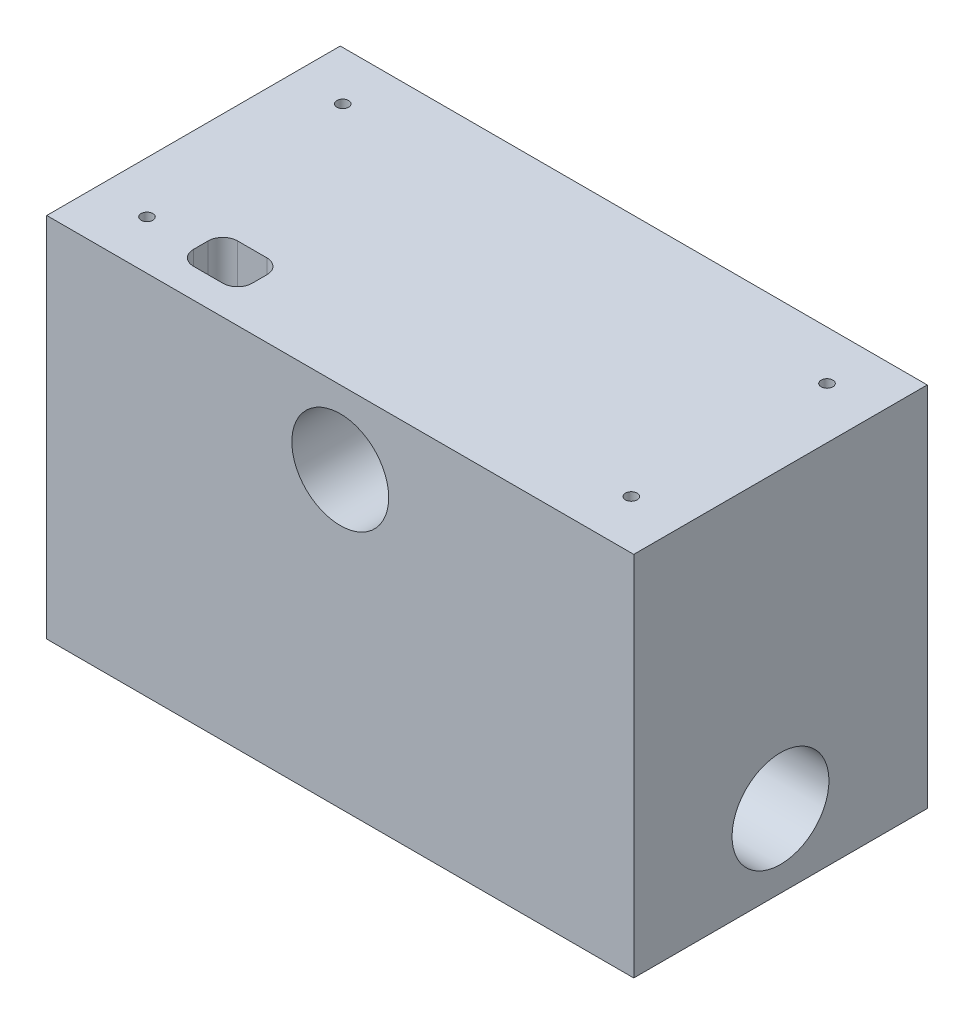
ISO-10303-21;
HEADER;
FILE_DESCRIPTION(('STEP AP214'),'2;1');
FILE_NAME('part.step','',(''),(''),'','','');
FILE_SCHEMA(('AUTOMOTIVE_DESIGN { 1 0 10303 214 1 1 1 1 }'));
ENDSEC;
DATA;
#1=APPLICATION_CONTEXT('core data for automotive mechanical design processes');
#2=APPLICATION_PROTOCOL_DEFINITION('international standard','automotive_design',2000,#1);
#3=PRODUCT_CONTEXT('',#1,'mechanical');
#4=PRODUCT('Part','Part','',(#3));
#5=PRODUCT_RELATED_PRODUCT_CATEGORY('part','',(#4));
#6=PRODUCT_DEFINITION_FORMATION('','',#4);
#7=PRODUCT_DEFINITION_CONTEXT('part definition',#1,'design');
#8=PRODUCT_DEFINITION('design','',#6,#7);
#9=PRODUCT_DEFINITION_SHAPE('','',#8);
#10=(LENGTH_UNIT() NAMED_UNIT(*) SI_UNIT(.MILLI.,.METRE.));
#11=(NAMED_UNIT(*) PLANE_ANGLE_UNIT() SI_UNIT($,.RADIAN.));
#12=(NAMED_UNIT(*) SI_UNIT($,.STERADIAN.) SOLID_ANGLE_UNIT());
#13=UNCERTAINTY_MEASURE_WITH_UNIT(LENGTH_MEASURE(1.E-05),#10,'distance_accuracy_value','');
#14=(GEOMETRIC_REPRESENTATION_CONTEXT(3) GLOBAL_UNCERTAINTY_ASSIGNED_CONTEXT((#13)) GLOBAL_UNIT_ASSIGNED_CONTEXT((#10,
#11,#12)) REPRESENTATION_CONTEXT('',''));
#15=CARTESIAN_POINT('',(0.,0.,0.));
#16=DIRECTION('',(0.,0.,1.));
#17=DIRECTION('',(1.,0.,0.));
#18=AXIS2_PLACEMENT_3D('',#15,#16,#17);
#19=CARTESIAN_POINT('',(25.4,15.875,25.4));
#20=DIRECTION('',(-1.,0.,0.));
#21=DIRECTION('',(0.,-1.,0.));
#22=AXIS2_PLACEMENT_3D('',#19,#20,#21);
#23=PLANE('',#22);
#24=CARTESIAN_POINT('',(25.4,-9.52500000000001,12.7));
#25=DIRECTION('',(-1.,0.,0.));
#26=DIRECTION('',(0.,-1.,0.));
#27=AXIS2_PLACEMENT_3D('',#24,#25,#26);
#28=CIRCLE('',#27,4.191);
#29=CARTESIAN_POINT('',(25.4,-13.716,12.7));
#30=VERTEX_POINT('',#29);
#31=EDGE_CURVE('E273',#30,#30,#28,.T.);
#32=ORIENTED_EDGE('',*,*,#31,.T.);
#33=EDGE_LOOP('',(#32));
#34=FACE_BOUND('',#33,.T.);
#35=DIRECTION('',(0.,1.,0.));
#36=VECTOR('',#35,1.);
#37=CARTESIAN_POINT('',(25.4,15.875,0.));
#38=LINE('',#37,#36);
#39=CARTESIAN_POINT('',(25.4,-15.875,0.));
#40=VERTEX_POINT('',#39);
#41=CARTESIAN_POINT('',(25.4,15.875,0.));
#42=VERTEX_POINT('',#41);
#43=EDGE_CURVE('E148',#40,#42,#38,.T.);
#44=ORIENTED_EDGE('',*,*,#43,.T.);
#45=DIRECTION('',(0.,0.,-1.));
#46=VECTOR('',#45,1.);
#47=CARTESIAN_POINT('',(25.4,15.875,25.4));
#48=LINE('',#47,#46);
#49=CARTESIAN_POINT('',(25.4,15.875,25.4));
#50=VERTEX_POINT('',#49);
#51=EDGE_CURVE('E129',#50,#42,#48,.T.);
#52=ORIENTED_EDGE('',*,*,#51,.F.);
#53=DIRECTION('',(0.,1.,0.));
#54=VECTOR('',#53,1.);
#55=CARTESIAN_POINT('',(25.4,15.875,25.4));
#56=LINE('',#55,#54);
#57=CARTESIAN_POINT('',(25.4,-15.875,25.4));
#58=VERTEX_POINT('',#57);
#59=EDGE_CURVE('E136',#58,#50,#56,.T.);
#60=ORIENTED_EDGE('',*,*,#59,.F.);
#61=DIRECTION('',(0.,0.,-1.));
#62=VECTOR('',#61,1.);
#63=CARTESIAN_POINT('',(25.4,-15.875,25.4));
#64=LINE('',#63,#62);
#65=EDGE_CURVE('E278',#58,#40,#64,.T.);
#66=ORIENTED_EDGE('',*,*,#65,.T.);
#67=EDGE_LOOP('',(#44,#52,#60,#66));
#68=FACE_BOUND('',#67,.T.);
#69=ADVANCED_FACE('F35',(#34,#68),#23,.F.);
#70=CARTESIAN_POINT('',(-25.4,15.875,25.4));
#71=DIRECTION('',(0.,-1.,0.));
#72=DIRECTION('',(0.,0.,-1.));
#73=AXIS2_PLACEMENT_3D('',#70,#71,#72);
#74=PLANE('',#73);
#75=DIRECTION('',(1.,0.,0.));
#76=VECTOR('',#75,1.);
#77=CARTESIAN_POINT('',(-16.51,15.875,22.86));
#78=LINE('',#77,#76);
#79=CARTESIAN_POINT('',(-15.24,15.875,22.86));
#80=VERTEX_POINT('',#79);
#81=CARTESIAN_POINT('',(-12.7,15.875,22.86));
#82=VERTEX_POINT('',#81);
#83=EDGE_CURVE('E197',#80,#82,#78,.T.);
#84=ORIENTED_EDGE('',*,*,#83,.F.);
#85=CARTESIAN_POINT('',(-15.24,15.875,21.59));
#86=DIRECTION('',(0.,-1.,0.));
#87=DIRECTION('',(0.,0.,-1.));
#88=AXIS2_PLACEMENT_3D('',#85,#86,#87);
#89=CIRCLE('',#88,1.27);
#90=CARTESIAN_POINT('',(-16.51,15.875,21.59));
#91=VERTEX_POINT('',#90);
#92=EDGE_CURVE('E191',#80,#91,#89,.T.);
#93=ORIENTED_EDGE('',*,*,#92,.T.);
#94=DIRECTION('',(0.,0.,1.));
#95=VECTOR('',#94,1.);
#96=CARTESIAN_POINT('',(-16.51,15.875,19.05));
#97=LINE('',#96,#95);
#98=CARTESIAN_POINT('',(-16.51,15.875,20.32));
#99=VERTEX_POINT('',#98);
#100=EDGE_CURVE('E204',#99,#91,#97,.T.);
#101=ORIENTED_EDGE('',*,*,#100,.F.);
#102=CARTESIAN_POINT('',(-15.24,15.875,20.32));
#103=DIRECTION('',(0.,-1.,0.));
#104=DIRECTION('',(0.,0.,-1.));
#105=AXIS2_PLACEMENT_3D('',#102,#103,#104);
#106=CIRCLE('',#105,1.27);
#107=CARTESIAN_POINT('',(-15.24,15.875,19.05));
#108=VERTEX_POINT('',#107);
#109=EDGE_CURVE('E187',#99,#108,#106,.T.);
#110=ORIENTED_EDGE('',*,*,#109,.T.);
#111=DIRECTION('',(-1.,0.,0.));
#112=VECTOR('',#111,1.);
#113=CARTESIAN_POINT('',(-16.51,15.875,19.05));
#114=LINE('',#113,#112);
#115=CARTESIAN_POINT('',(-12.7,15.875,19.05));
#116=VERTEX_POINT('',#115);
#117=EDGE_CURVE('E224',#116,#108,#114,.T.);
#118=ORIENTED_EDGE('',*,*,#117,.F.);
#119=CARTESIAN_POINT('',(-12.7,15.875,20.32));
#120=DIRECTION('',(0.,-1.,0.));
#121=DIRECTION('',(0.,0.,-1.));
#122=AXIS2_PLACEMENT_3D('',#119,#120,#121);
#123=CIRCLE('',#122,1.27);
#124=CARTESIAN_POINT('',(-11.43,15.875,20.32));
#125=VERTEX_POINT('',#124);
#126=EDGE_CURVE('E183',#116,#125,#123,.T.);
#127=ORIENTED_EDGE('',*,*,#126,.T.);
#128=DIRECTION('',(0.,0.,-1.));
#129=VECTOR('',#128,1.);
#130=CARTESIAN_POINT('',(-11.43,15.875,19.05));
#131=LINE('',#130,#129);
#132=CARTESIAN_POINT('',(-11.43,15.875,21.59));
#133=VERTEX_POINT('',#132);
#134=EDGE_CURVE('E199',#133,#125,#131,.T.);
#135=ORIENTED_EDGE('',*,*,#134,.F.);
#136=CARTESIAN_POINT('',(-12.7,15.875,21.59));
#137=DIRECTION('',(0.,-1.,0.));
#138=DIRECTION('',(0.,0.,-1.));
#139=AXIS2_PLACEMENT_3D('',#136,#137,#138);
#140=CIRCLE('',#139,1.27);
#141=EDGE_CURVE('E43',#133,#82,#140,.T.);
#142=ORIENTED_EDGE('',*,*,#141,.T.);
#143=EDGE_LOOP('',(#84,#93,#101,#110,#118,#127,#135,#142));
#144=FACE_BOUND('',#143,.T.);
#145=CARTESIAN_POINT('',(20.955,15.875,21.1709));
#146=DIRECTION('',(0.,1.,0.));
#147=DIRECTION('',(0.,0.,1.));
#148=AXIS2_PLACEMENT_3D('',#145,#146,#147);
#149=CIRCLE('',#148,0.508000000000002);
#150=CARTESIAN_POINT('',(20.955,15.875,21.6789));
#151=VERTEX_POINT('',#150);
#152=EDGE_CURVE('E240',#151,#151,#149,.T.);
#153=ORIENTED_EDGE('',*,*,#152,.F.);
#154=EDGE_LOOP('',(#153));
#155=FACE_BOUND('',#154,.T.);
#156=CARTESIAN_POINT('',(20.955,15.875,4.2291));
#157=DIRECTION('',(0.,1.,0.));
#158=DIRECTION('',(0.,0.,1.));
#159=AXIS2_PLACEMENT_3D('',#156,#157,#158);
#160=CIRCLE('',#159,0.508000000000002);
#161=CARTESIAN_POINT('',(20.955,15.875,4.7371));
#162=VERTEX_POINT('',#161);
#163=EDGE_CURVE('E244',#162,#162,#160,.T.);
#164=ORIENTED_EDGE('',*,*,#163,.F.);
#165=EDGE_LOOP('',(#164));
#166=FACE_BOUND('',#165,.T.);
#167=CARTESIAN_POINT('',(-20.955,15.875,21.1709));
#168=DIRECTION('',(0.,1.,0.));
#169=DIRECTION('',(0.,0.,1.));
#170=AXIS2_PLACEMENT_3D('',#167,#168,#169);
#171=CIRCLE('',#170,0.508000000000002);
#172=CARTESIAN_POINT('',(-20.955,15.875,21.6789));
#173=VERTEX_POINT('',#172);
#174=EDGE_CURVE('E250',#173,#173,#171,.T.);
#175=ORIENTED_EDGE('',*,*,#174,.F.);
#176=EDGE_LOOP('',(#175));
#177=FACE_BOUND('',#176,.T.);
#178=CARTESIAN_POINT('',(-20.955,15.875,4.2291));
#179=DIRECTION('',(0.,1.,0.));
#180=DIRECTION('',(0.,0.,1.));
#181=AXIS2_PLACEMENT_3D('',#178,#179,#180);
#182=CIRCLE('',#181,0.508000000000002);
#183=CARTESIAN_POINT('',(-20.955,15.875,4.7371));
#184=VERTEX_POINT('',#183);
#185=EDGE_CURVE('E256',#184,#184,#182,.T.);
#186=ORIENTED_EDGE('',*,*,#185,.F.);
#187=EDGE_LOOP('',(#186));
#188=FACE_BOUND('',#187,.T.);
#189=DIRECTION('',(-1.,0.,0.));
#190=VECTOR('',#189,1.);
#191=CARTESIAN_POINT('',(-25.4,15.875,0.));
#192=LINE('',#191,#190);
#193=CARTESIAN_POINT('',(-25.4,15.875,0.));
#194=VERTEX_POINT('',#193);
#195=EDGE_CURVE('E280',#42,#194,#192,.T.);
#196=ORIENTED_EDGE('',*,*,#195,.T.);
#197=DIRECTION('',(0.,0.,-1.));
#198=VECTOR('',#197,1.);
#199=CARTESIAN_POINT('',(-25.4,15.875,25.4));
#200=LINE('',#199,#198);
#201=CARTESIAN_POINT('',(-25.4,15.875,25.4));
#202=VERTEX_POINT('',#201);
#203=EDGE_CURVE('E132',#202,#194,#200,.T.);
#204=ORIENTED_EDGE('',*,*,#203,.F.);
#205=DIRECTION('',(-1.,0.,0.));
#206=VECTOR('',#205,1.);
#207=CARTESIAN_POINT('',(-25.4,15.875,25.4));
#208=LINE('',#207,#206);
#209=EDGE_CURVE('E125',#50,#202,#208,.T.);
#210=ORIENTED_EDGE('',*,*,#209,.F.);
#211=ORIENTED_EDGE('',*,*,#51,.T.);
#212=EDGE_LOOP('',(#196,#204,#210,#211));
#213=FACE_BOUND('',#212,.T.);
#214=ADVANCED_FACE('F127',(#144,#155,#166,#177,#188,#213),#74,.F.);
#215=CARTESIAN_POINT('',(-25.4,15.875,25.4));
#216=DIRECTION('',(1.,0.,0.));
#217=DIRECTION('',(0.,1.,0.));
#218=AXIS2_PLACEMENT_3D('',#215,#216,#217);
#219=PLANE('',#218);
#220=CARTESIAN_POINT('',(-25.4,-9.525,12.7));
#221=DIRECTION('',(-1.,0.,0.));
#222=DIRECTION('',(0.,-1.,0.));
#223=AXIS2_PLACEMENT_3D('',#220,#221,#222);
#224=CIRCLE('',#223,4.191);
#225=CARTESIAN_POINT('',(-25.4,-13.716,12.7));
#226=VERTEX_POINT('',#225);
#227=EDGE_CURVE('E268',#226,#226,#224,.T.);
#228=ORIENTED_EDGE('',*,*,#227,.F.);
#229=EDGE_LOOP('',(#228));
#230=FACE_BOUND('',#229,.T.);
#231=DIRECTION('',(0.,-1.,0.));
#232=VECTOR('',#231,1.);
#233=CARTESIAN_POINT('',(-25.4,15.875,0.));
#234=LINE('',#233,#232);
#235=CARTESIAN_POINT('',(-25.4,-15.875,0.));
#236=VERTEX_POINT('',#235);
#237=EDGE_CURVE('E282',#194,#236,#234,.T.);
#238=ORIENTED_EDGE('',*,*,#237,.T.);
#239=DIRECTION('',(0.,0.,-1.));
#240=VECTOR('',#239,1.);
#241=CARTESIAN_POINT('',(-25.4,-15.875,25.4));
#242=LINE('',#241,#240);
#243=CARTESIAN_POINT('',(-25.4,-15.875,25.4));
#244=VERTEX_POINT('',#243);
#245=EDGE_CURVE('E153',#244,#236,#242,.T.);
#246=ORIENTED_EDGE('',*,*,#245,.F.);
#247=DIRECTION('',(0.,-1.,0.));
#248=VECTOR('',#247,1.);
#249=CARTESIAN_POINT('',(-25.4,15.875,25.4));
#250=LINE('',#249,#248);
#251=EDGE_CURVE('E135',#202,#244,#250,.T.);
#252=ORIENTED_EDGE('',*,*,#251,.F.);
#253=ORIENTED_EDGE('',*,*,#203,.T.);
#254=EDGE_LOOP('',(#238,#246,#252,#253));
#255=FACE_BOUND('',#254,.T.);
#256=ADVANCED_FACE('F292',(#230,#255),#219,.F.);
#257=CARTESIAN_POINT('',(-25.4,-15.875,25.4));
#258=DIRECTION('',(0.,1.,0.));
#259=DIRECTION('',(0.,0.,1.));
#260=AXIS2_PLACEMENT_3D('',#257,#258,#259);
#261=PLANE('',#260);
#262=DIRECTION('',(0.,0.,-1.));
#263=VECTOR('',#262,1.);
#264=CARTESIAN_POINT('',(-11.43,-15.875,25.4));
#265=LINE('',#264,#263);
#266=CARTESIAN_POINT('',(-11.43,-15.875,21.59));
#267=VERTEX_POINT('',#266);
#268=CARTESIAN_POINT('',(-11.43,-15.875,20.32));
#269=VERTEX_POINT('',#268);
#270=EDGE_CURVE('E151',#267,#269,#265,.T.);
#271=ORIENTED_EDGE('',*,*,#270,.T.);
#272=CARTESIAN_POINT('',(-12.7,-15.875,20.32));
#273=DIRECTION('',(0.,1.,0.));
#274=DIRECTION('',(0.,0.,1.));
#275=AXIS2_PLACEMENT_3D('',#272,#273,#274);
#276=CIRCLE('',#275,1.27);
#277=CARTESIAN_POINT('',(-12.7,-15.875,19.05));
#278=VERTEX_POINT('',#277);
#279=EDGE_CURVE('E185',#269,#278,#276,.T.);
#280=ORIENTED_EDGE('',*,*,#279,.T.);
#281=DIRECTION('',(-1.,0.,0.));
#282=VECTOR('',#281,1.);
#283=CARTESIAN_POINT('',(-25.4,-15.875,19.05));
#284=LINE('',#283,#282);
#285=CARTESIAN_POINT('',(-15.24,-15.875,19.05));
#286=VERTEX_POINT('',#285);
#287=EDGE_CURVE('E159',#278,#286,#284,.T.);
#288=ORIENTED_EDGE('',*,*,#287,.T.);
#289=CARTESIAN_POINT('',(-15.24,-15.875,20.32));
#290=DIRECTION('',(0.,1.,0.));
#291=DIRECTION('',(0.,0.,1.));
#292=AXIS2_PLACEMENT_3D('',#289,#290,#291);
#293=CIRCLE('',#292,1.27);
#294=CARTESIAN_POINT('',(-16.51,-15.875,20.32));
#295=VERTEX_POINT('',#294);
#296=EDGE_CURVE('E189',#286,#295,#293,.T.);
#297=ORIENTED_EDGE('',*,*,#296,.T.);
#298=DIRECTION('',(0.,0.,1.));
#299=VECTOR('',#298,1.);
#300=CARTESIAN_POINT('',(-16.51,-15.875,25.4));
#301=LINE('',#300,#299);
#302=CARTESIAN_POINT('',(-16.51,-15.875,21.59));
#303=VERTEX_POINT('',#302);
#304=EDGE_CURVE('E162',#295,#303,#301,.T.);
#305=ORIENTED_EDGE('',*,*,#304,.T.);
#306=CARTESIAN_POINT('',(-15.24,-15.875,21.59));
#307=DIRECTION('',(0.,1.,0.));
#308=DIRECTION('',(0.,0.,1.));
#309=AXIS2_PLACEMENT_3D('',#306,#307,#308);
#310=CIRCLE('',#309,1.27);
#311=CARTESIAN_POINT('',(-15.24,-15.875,22.86));
#312=VERTEX_POINT('',#311);
#313=EDGE_CURVE('E57',#303,#312,#310,.T.);
#314=ORIENTED_EDGE('',*,*,#313,.T.);
#315=DIRECTION('',(1.,0.,0.));
#316=VECTOR('',#315,1.);
#317=CARTESIAN_POINT('',(-25.4,-15.875,22.86));
#318=LINE('',#317,#316);
#319=CARTESIAN_POINT('',(-12.7,-15.875,22.86));
#320=VERTEX_POINT('',#319);
#321=EDGE_CURVE('E149',#312,#320,#318,.T.);
#322=ORIENTED_EDGE('',*,*,#321,.T.);
#323=CARTESIAN_POINT('',(-12.7,-15.875,21.59));
#324=DIRECTION('',(0.,1.,0.));
#325=DIRECTION('',(0.,0.,1.));
#326=AXIS2_PLACEMENT_3D('',#323,#324,#325);
#327=CIRCLE('',#326,1.27);
#328=EDGE_CURVE('E11',#320,#267,#327,.T.);
#329=ORIENTED_EDGE('',*,*,#328,.T.);
#330=EDGE_LOOP('',(#271,#280,#288,#297,#305,#314,#322,#329));
#331=FACE_BOUND('',#330,.T.);
#332=DIRECTION('',(1.,0.,0.));
#333=VECTOR('',#332,1.);
#334=CARTESIAN_POINT('',(-25.4,-15.875,0.));
#335=LINE('',#334,#333);
#336=EDGE_CURVE('E145',#236,#40,#335,.T.);
#337=ORIENTED_EDGE('',*,*,#336,.T.);
#338=ORIENTED_EDGE('',*,*,#65,.F.);
#339=DIRECTION('',(1.,0.,0.));
#340=VECTOR('',#339,1.);
#341=CARTESIAN_POINT('',(-25.4,-15.875,25.4));
#342=LINE('',#341,#340);
#343=EDGE_CURVE('E141',#244,#58,#342,.T.);
#344=ORIENTED_EDGE('',*,*,#343,.F.);
#345=ORIENTED_EDGE('',*,*,#245,.T.);
#346=EDGE_LOOP('',(#337,#338,#344,#345));
#347=FACE_BOUND('',#346,.T.);
#348=ADVANCED_FACE('F208',(#331,#347),#261,.F.);
#349=CARTESIAN_POINT('',(0.,0.,25.4));
#350=DIRECTION('',(0.,0.,1.));
#351=DIRECTION('',(1.,0.,0.));
#352=AXIS2_PLACEMENT_3D('',#349,#350,#351);
#353=PLANE('',#352);
#354=CARTESIAN_POINT('',(0.,9.525,25.4));
#355=DIRECTION('',(0.,0.,1.));
#356=DIRECTION('',(1.,0.,0.));
#357=AXIS2_PLACEMENT_3D('',#354,#355,#356);
#358=CIRCLE('',#357,4.191);
#359=CARTESIAN_POINT('',(4.191,9.525,25.4));
#360=VERTEX_POINT('',#359);
#361=EDGE_CURVE('E262',#360,#360,#358,.T.);
#362=ORIENTED_EDGE('',*,*,#361,.F.);
#363=EDGE_LOOP('',(#362));
#364=FACE_BOUND('',#363,.T.);
#365=ORIENTED_EDGE('',*,*,#59,.T.);
#366=ORIENTED_EDGE('',*,*,#209,.T.);
#367=ORIENTED_EDGE('',*,*,#251,.T.);
#368=ORIENTED_EDGE('',*,*,#343,.T.);
#369=EDGE_LOOP('',(#365,#366,#367,#368));
#370=FACE_BOUND('',#369,.T.);
#371=ADVANCED_FACE('F139',(#364,#370),#353,.T.);
#372=CARTESIAN_POINT('',(0.,0.,0.));
#373=DIRECTION('',(0.,0.,1.));
#374=DIRECTION('',(1.,0.,0.));
#375=AXIS2_PLACEMENT_3D('',#372,#373,#374);
#376=PLANE('',#375);
#377=CARTESIAN_POINT('',(0.,9.525,0.));
#378=DIRECTION('',(0.,0.,1.));
#379=DIRECTION('',(1.,0.,0.));
#380=AXIS2_PLACEMENT_3D('',#377,#378,#379);
#381=CIRCLE('',#380,4.191);
#382=CARTESIAN_POINT('',(4.191,9.525,0.));
#383=VERTEX_POINT('',#382);
#384=EDGE_CURVE('E265',#383,#383,#381,.T.);
#385=ORIENTED_EDGE('',*,*,#384,.T.);
#386=EDGE_LOOP('',(#385));
#387=FACE_BOUND('',#386,.T.);
#388=ORIENTED_EDGE('',*,*,#43,.F.);
#389=ORIENTED_EDGE('',*,*,#336,.F.);
#390=ORIENTED_EDGE('',*,*,#237,.F.);
#391=ORIENTED_EDGE('',*,*,#195,.F.);
#392=EDGE_LOOP('',(#388,#389,#390,#391));
#393=FACE_BOUND('',#392,.T.);
#394=ADVANCED_FACE('F291',(#387,#393),#376,.F.);
#395=CARTESIAN_POINT('',(127.,-9.52500000000003,12.7));
#396=DIRECTION('',(-1.,0.,0.));
#397=DIRECTION('',(0.,-1.,0.));
#398=AXIS2_PLACEMENT_3D('',#395,#396,#397);
#399=CYLINDRICAL_SURFACE('',#398,4.191);
#400=ORIENTED_EDGE('',*,*,#227,.T.);
#401=EDGE_LOOP('',(#400));
#402=FACE_BOUND('',#401,.T.);
#403=ORIENTED_EDGE('',*,*,#31,.F.);
#404=EDGE_LOOP('',(#403));
#405=FACE_BOUND('',#404,.T.);
#406=ADVANCED_FACE('F472',(#402,#405),#399,.F.);
#407=CARTESIAN_POINT('',(0.,9.525,0.));
#408=DIRECTION('',(0.,0.,1.));
#409=DIRECTION('',(1.,0.,0.));
#410=AXIS2_PLACEMENT_3D('',#407,#408,#409);
#411=CYLINDRICAL_SURFACE('',#410,4.191);
#412=ORIENTED_EDGE('',*,*,#384,.F.);
#413=EDGE_LOOP('',(#412));
#414=FACE_BOUND('',#413,.T.);
#415=ORIENTED_EDGE('',*,*,#361,.T.);
#416=EDGE_LOOP('',(#415));
#417=FACE_BOUND('',#416,.T.);
#418=ADVANCED_FACE('F462',(#414,#417),#411,.F.);
#419=CARTESIAN_POINT('',(-20.955,8.255,4.2291));
#420=DIRECTION('',(0.,1.,0.));
#421=DIRECTION('',(0.,0.,1.));
#422=AXIS2_PLACEMENT_3D('',#419,#420,#421);
#423=CYLINDRICAL_SURFACE('',#422,0.508000000000002);
#424=CARTESIAN_POINT('',(-20.955,8.255,4.2291));
#425=DIRECTION('',(0.,1.,0.));
#426=DIRECTION('',(0.,0.,1.));
#427=AXIS2_PLACEMENT_3D('',#424,#425,#426);
#428=CIRCLE('',#427,0.508000000000002);
#429=CARTESIAN_POINT('',(-20.955,8.255,4.7371));
#430=VERTEX_POINT('',#429);
#431=EDGE_CURVE('E259',#430,#430,#428,.T.);
#432=ORIENTED_EDGE('',*,*,#431,.F.);
#433=EDGE_LOOP('',(#432));
#434=FACE_BOUND('',#433,.T.);
#435=ORIENTED_EDGE('',*,*,#185,.T.);
#436=EDGE_LOOP('',(#435));
#437=FACE_BOUND('',#436,.T.);
#438=ADVANCED_FACE('F452',(#434,#437),#423,.F.);
#439=CARTESIAN_POINT('',(-20.955,8.255,4.2291));
#440=DIRECTION('',(0.,1.,0.));
#441=DIRECTION('',(0.,0.,1.));
#442=AXIS2_PLACEMENT_3D('',#439,#440,#441);
#443=PLANE('',#442);
#444=ORIENTED_EDGE('',*,*,#431,.T.);
#445=EDGE_LOOP('',(#444));
#446=FACE_BOUND('',#445,.T.);
#447=ADVANCED_FACE('F442',(#446),#443,.T.);
#448=CARTESIAN_POINT('',(-20.955,8.255,21.1709));
#449=DIRECTION('',(0.,1.,0.));
#450=DIRECTION('',(0.,0.,1.));
#451=AXIS2_PLACEMENT_3D('',#448,#449,#450);
#452=CYLINDRICAL_SURFACE('',#451,0.508000000000002);
#453=CARTESIAN_POINT('',(-20.955,8.255,21.1709));
#454=DIRECTION('',(0.,1.,0.));
#455=DIRECTION('',(0.,0.,1.));
#456=AXIS2_PLACEMENT_3D('',#453,#454,#455);
#457=CIRCLE('',#456,0.508000000000002);
#458=CARTESIAN_POINT('',(-20.955,8.255,21.6789));
#459=VERTEX_POINT('',#458);
#460=EDGE_CURVE('E253',#459,#459,#457,.T.);
#461=ORIENTED_EDGE('',*,*,#460,.F.);
#462=EDGE_LOOP('',(#461));
#463=FACE_BOUND('',#462,.T.);
#464=ORIENTED_EDGE('',*,*,#174,.T.);
#465=EDGE_LOOP('',(#464));
#466=FACE_BOUND('',#465,.T.);
#467=ADVANCED_FACE('F432',(#463,#466),#452,.F.);
#468=CARTESIAN_POINT('',(-20.955,8.255,21.1709));
#469=DIRECTION('',(0.,1.,0.));
#470=DIRECTION('',(0.,0.,1.));
#471=AXIS2_PLACEMENT_3D('',#468,#469,#470);
#472=PLANE('',#471);
#473=ORIENTED_EDGE('',*,*,#460,.T.);
#474=EDGE_LOOP('',(#473));
#475=FACE_BOUND('',#474,.T.);
#476=ADVANCED_FACE('F422',(#475),#472,.T.);
#477=CARTESIAN_POINT('',(20.955,8.255,4.2291));
#478=DIRECTION('',(0.,1.,0.));
#479=DIRECTION('',(0.,0.,1.));
#480=AXIS2_PLACEMENT_3D('',#477,#478,#479);
#481=CYLINDRICAL_SURFACE('',#480,0.508000000000002);
#482=CARTESIAN_POINT('',(20.955,8.255,4.2291));
#483=DIRECTION('',(0.,1.,0.));
#484=DIRECTION('',(0.,0.,1.));
#485=AXIS2_PLACEMENT_3D('',#482,#483,#484);
#486=CIRCLE('',#485,0.508000000000002);
#487=CARTESIAN_POINT('',(20.955,8.255,4.7371));
#488=VERTEX_POINT('',#487);
#489=EDGE_CURVE('E247',#488,#488,#486,.T.);
#490=ORIENTED_EDGE('',*,*,#489,.F.);
#491=EDGE_LOOP('',(#490));
#492=FACE_BOUND('',#491,.T.);
#493=ORIENTED_EDGE('',*,*,#163,.T.);
#494=EDGE_LOOP('',(#493));
#495=FACE_BOUND('',#494,.T.);
#496=ADVANCED_FACE('F412',(#492,#495),#481,.F.);
#497=CARTESIAN_POINT('',(20.955,8.255,4.2291));
#498=DIRECTION('',(0.,1.,0.));
#499=DIRECTION('',(0.,0.,1.));
#500=AXIS2_PLACEMENT_3D('',#497,#498,#499);
#501=PLANE('',#500);
#502=ORIENTED_EDGE('',*,*,#489,.T.);
#503=EDGE_LOOP('',(#502));
#504=FACE_BOUND('',#503,.T.);
#505=ADVANCED_FACE('F402',(#504),#501,.T.);
#506=CARTESIAN_POINT('',(20.955,8.255,21.1709));
#507=DIRECTION('',(0.,1.,0.));
#508=DIRECTION('',(0.,0.,1.));
#509=AXIS2_PLACEMENT_3D('',#506,#507,#508);
#510=CYLINDRICAL_SURFACE('',#509,0.508000000000002);
#511=CARTESIAN_POINT('',(20.955,8.255,21.1709));
#512=DIRECTION('',(0.,1.,0.));
#513=DIRECTION('',(0.,0.,1.));
#514=AXIS2_PLACEMENT_3D('',#511,#512,#513);
#515=CIRCLE('',#514,0.508000000000002);
#516=CARTESIAN_POINT('',(20.955,8.255,21.6789));
#517=VERTEX_POINT('',#516);
#518=EDGE_CURVE('E241',#517,#517,#515,.T.);
#519=ORIENTED_EDGE('',*,*,#518,.F.);
#520=EDGE_LOOP('',(#519));
#521=FACE_BOUND('',#520,.T.);
#522=ORIENTED_EDGE('',*,*,#152,.T.);
#523=EDGE_LOOP('',(#522));
#524=FACE_BOUND('',#523,.T.);
#525=ADVANCED_FACE('F392',(#521,#524),#510,.F.);
#526=CARTESIAN_POINT('',(20.955,8.255,21.1709));
#527=DIRECTION('',(0.,1.,0.));
#528=DIRECTION('',(0.,0.,1.));
#529=AXIS2_PLACEMENT_3D('',#526,#527,#528);
#530=PLANE('',#529);
#531=ORIENTED_EDGE('',*,*,#518,.T.);
#532=EDGE_LOOP('',(#531));
#533=FACE_BOUND('',#532,.T.);
#534=ADVANCED_FACE('F367',(#533),#530,.T.);
#535=CARTESIAN_POINT('',(-16.51,-136.525,19.05));
#536=DIRECTION('',(-1.,0.,0.));
#537=DIRECTION('',(0.,0.,1.));
#538=AXIS2_PLACEMENT_3D('',#535,#536,#537);
#539=PLANE('',#538);
#540=ORIENTED_EDGE('',*,*,#304,.F.);
#541=DIRECTION('',(0.,1.,0.));
#542=VECTOR('',#541,1.);
#543=CARTESIAN_POINT('',(-16.51,15.875,20.32));
#544=LINE('',#543,#542);
#545=EDGE_CURVE('E176',#295,#99,#544,.T.);
#546=ORIENTED_EDGE('',*,*,#545,.T.);
#547=ORIENTED_EDGE('',*,*,#100,.T.);
#548=DIRECTION('',(0.,1.,0.));
#549=VECTOR('',#548,1.);
#550=CARTESIAN_POINT('',(-16.51,-15.875,21.59));
#551=LINE('',#550,#549);
#552=EDGE_CURVE('E174',#91,#303,#551,.F.);
#553=ORIENTED_EDGE('',*,*,#552,.T.);
#554=EDGE_LOOP('',(#540,#546,#547,#553));
#555=FACE_BOUND('',#554,.T.);
#556=ADVANCED_FACE('F230',(#555),#539,.F.);
#557=CARTESIAN_POINT('',(-16.51,-136.525,19.05));
#558=DIRECTION('',(0.,0.,-1.));
#559=DIRECTION('',(-1.,0.,0.));
#560=AXIS2_PLACEMENT_3D('',#557,#558,#559);
#561=PLANE('',#560);
#562=ORIENTED_EDGE('',*,*,#287,.F.);
#563=DIRECTION('',(0.,1.,0.));
#564=VECTOR('',#563,1.);
#565=CARTESIAN_POINT('',(-12.7,15.875,19.05));
#566=LINE('',#565,#564);
#567=EDGE_CURVE('E166',#278,#116,#566,.T.);
#568=ORIENTED_EDGE('',*,*,#567,.T.);
#569=ORIENTED_EDGE('',*,*,#117,.T.);
#570=DIRECTION('',(0.,1.,0.));
#571=VECTOR('',#570,1.);
#572=CARTESIAN_POINT('',(-15.24,-15.875,19.05));
#573=LINE('',#572,#571);
#574=EDGE_CURVE('E164',#108,#286,#573,.F.);
#575=ORIENTED_EDGE('',*,*,#574,.T.);
#576=EDGE_LOOP('',(#562,#568,#569,#575));
#577=FACE_BOUND('',#576,.T.);
#578=ADVANCED_FACE('F220',(#577),#561,.F.);
#579=CARTESIAN_POINT('',(-11.43,-136.525,19.05));
#580=DIRECTION('',(1.,0.,0.));
#581=DIRECTION('',(0.,0.,-1.));
#582=AXIS2_PLACEMENT_3D('',#579,#580,#581);
#583=PLANE('',#582);
#584=ORIENTED_EDGE('',*,*,#134,.T.);
#585=DIRECTION('',(0.,1.,0.));
#586=VECTOR('',#585,1.);
#587=CARTESIAN_POINT('',(-11.43,-15.875,20.32));
#588=LINE('',#587,#586);
#589=EDGE_CURVE('E172',#125,#269,#588,.F.);
#590=ORIENTED_EDGE('',*,*,#589,.T.);
#591=ORIENTED_EDGE('',*,*,#270,.F.);
#592=DIRECTION('',(0.,1.,0.));
#593=VECTOR('',#592,1.);
#594=CARTESIAN_POINT('',(-11.43,15.875,21.59));
#595=LINE('',#594,#593);
#596=EDGE_CURVE('E169',#267,#133,#595,.T.);
#597=ORIENTED_EDGE('',*,*,#596,.T.);
#598=EDGE_LOOP('',(#584,#590,#591,#597));
#599=FACE_BOUND('',#598,.T.);
#600=ADVANCED_FACE('F212',(#599),#583,.F.);
#601=CARTESIAN_POINT('',(-16.51,-136.525,22.86));
#602=DIRECTION('',(0.,0.,1.));
#603=DIRECTION('',(1.,0.,0.));
#604=AXIS2_PLACEMENT_3D('',#601,#602,#603);
#605=PLANE('',#604);
#606=ORIENTED_EDGE('',*,*,#321,.F.);
#607=DIRECTION('',(0.,1.,0.));
#608=VECTOR('',#607,1.);
#609=CARTESIAN_POINT('',(-15.24,15.875,22.86));
#610=LINE('',#609,#608);
#611=EDGE_CURVE('E180',#312,#80,#610,.T.);
#612=ORIENTED_EDGE('',*,*,#611,.T.);
#613=ORIENTED_EDGE('',*,*,#83,.T.);
#614=DIRECTION('',(0.,1.,0.));
#615=VECTOR('',#614,1.);
#616=CARTESIAN_POINT('',(-12.7,-15.875,22.86));
#617=LINE('',#616,#615);
#618=EDGE_CURVE('E50',#82,#320,#617,.F.);
#619=ORIENTED_EDGE('',*,*,#618,.T.);
#620=EDGE_LOOP('',(#606,#612,#613,#619));
#621=FACE_BOUND('',#620,.T.);
#622=ADVANCED_FACE('F202',(#621),#605,.F.);
#623=CARTESIAN_POINT('',(-12.7,-136.525,20.32));
#624=DIRECTION('',(0.,-1.,0.));
#625=DIRECTION('',(0.,0.,-1.));
#626=AXIS2_PLACEMENT_3D('',#623,#624,#625);
#627=CYLINDRICAL_SURFACE('',#626,1.27);
#628=ORIENTED_EDGE('',*,*,#279,.F.);
#629=ORIENTED_EDGE('',*,*,#589,.F.);
#630=ORIENTED_EDGE('',*,*,#126,.F.);
#631=ORIENTED_EDGE('',*,*,#567,.F.);
#632=EDGE_LOOP('',(#628,#629,#630,#631));
#633=FACE_BOUND('',#632,.T.);
#634=ADVANCED_FACE('F215',(#633),#627,.F.);
#635=CARTESIAN_POINT('',(-15.24,-136.525,20.32));
#636=DIRECTION('',(0.,-1.,0.));
#637=DIRECTION('',(0.,0.,-1.));
#638=AXIS2_PLACEMENT_3D('',#635,#636,#637);
#639=CYLINDRICAL_SURFACE('',#638,1.27);
#640=ORIENTED_EDGE('',*,*,#296,.F.);
#641=ORIENTED_EDGE('',*,*,#574,.F.);
#642=ORIENTED_EDGE('',*,*,#109,.F.);
#643=ORIENTED_EDGE('',*,*,#545,.F.);
#644=EDGE_LOOP('',(#640,#641,#642,#643));
#645=FACE_BOUND('',#644,.T.);
#646=ADVANCED_FACE('F226',(#645),#639,.F.);
#647=CARTESIAN_POINT('',(-15.24,-136.525,21.59));
#648=DIRECTION('',(0.,-1.,0.));
#649=DIRECTION('',(0.,0.,-1.));
#650=AXIS2_PLACEMENT_3D('',#647,#648,#649);
#651=CYLINDRICAL_SURFACE('',#650,1.27);
#652=ORIENTED_EDGE('',*,*,#313,.F.);
#653=ORIENTED_EDGE('',*,*,#552,.F.);
#654=ORIENTED_EDGE('',*,*,#92,.F.);
#655=ORIENTED_EDGE('',*,*,#611,.F.);
#656=EDGE_LOOP('',(#652,#653,#654,#655));
#657=FACE_BOUND('',#656,.T.);
#658=ADVANCED_FACE('F235',(#657),#651,.F.);
#659=CARTESIAN_POINT('',(-12.7,-136.525,21.59));
#660=DIRECTION('',(0.,-1.,0.));
#661=DIRECTION('',(0.,0.,-1.));
#662=AXIS2_PLACEMENT_3D('',#659,#660,#661);
#663=CYLINDRICAL_SURFACE('',#662,1.27);
#664=ORIENTED_EDGE('',*,*,#328,.F.);
#665=ORIENTED_EDGE('',*,*,#618,.F.);
#666=ORIENTED_EDGE('',*,*,#141,.F.);
#667=ORIENTED_EDGE('',*,*,#596,.F.);
#668=EDGE_LOOP('',(#664,#665,#666,#667));
#669=FACE_BOUND('',#668,.T.);
#670=ADVANCED_FACE('F37',(#669),#663,.F.);
#671=CLOSED_SHELL('',(#69,#214,#256,#348,#371,#394,#406,#418,#438,#447,#467,#476,#496,#505,#525,
#534,#556,#578,#600,#622,#634,#646,#658,#670));
#672=MANIFOLD_SOLID_BREP('B2',#671);
#673=ADVANCED_BREP_SHAPE_REPRESENTATION('',(#18,#672),#14);
#674=SHAPE_DEFINITION_REPRESENTATION(#9,#673);
ENDSEC;
END-ISO-10303-21;
